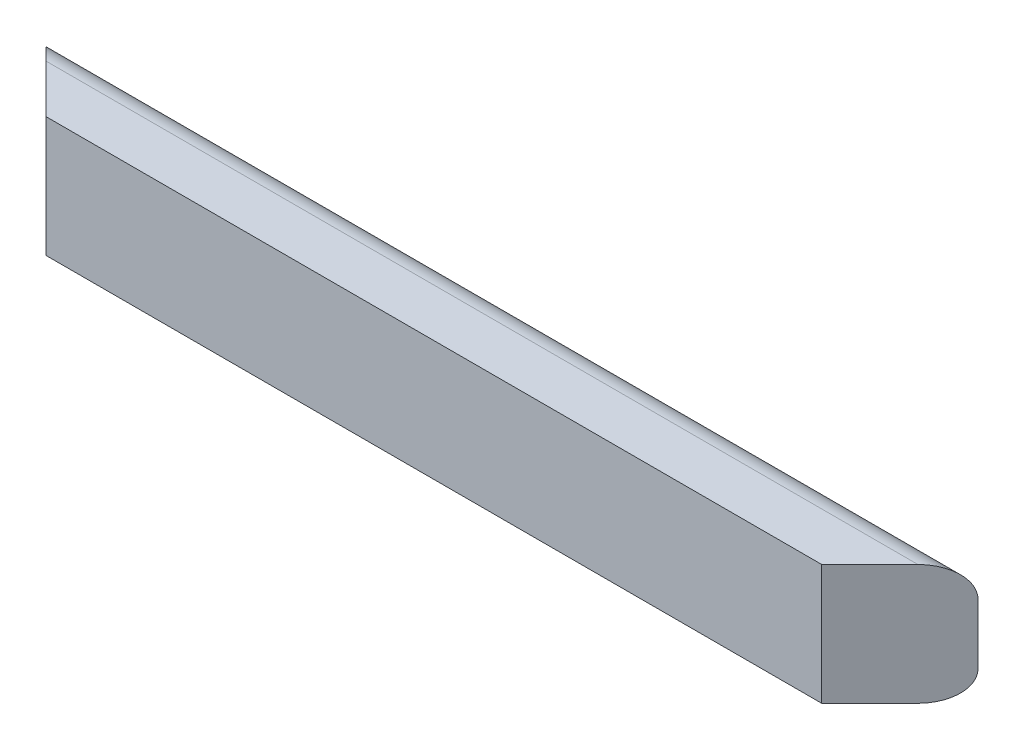
ISO-10303-21;
HEADER;
FILE_DESCRIPTION(('STEP AP214'),'2;1');
FILE_NAME('part.step','',(''),(''),'','','');
FILE_SCHEMA(('AUTOMOTIVE_DESIGN { 1 0 10303 214 1 1 1 1 }'));
ENDSEC;
DATA;
#1=APPLICATION_CONTEXT('core data for automotive mechanical design processes');
#2=APPLICATION_PROTOCOL_DEFINITION('international standard','automotive_design',2000,#1);
#3=PRODUCT_CONTEXT('',#1,'mechanical');
#4=PRODUCT('Part','Part','',(#3));
#5=PRODUCT_RELATED_PRODUCT_CATEGORY('part','',(#4));
#6=PRODUCT_DEFINITION_FORMATION('','',#4);
#7=PRODUCT_DEFINITION_CONTEXT('part definition',#1,'design');
#8=PRODUCT_DEFINITION('design','',#6,#7);
#9=PRODUCT_DEFINITION_SHAPE('','',#8);
#10=(LENGTH_UNIT() NAMED_UNIT(*) SI_UNIT(.MILLI.,.METRE.));
#11=(NAMED_UNIT(*) PLANE_ANGLE_UNIT() SI_UNIT($,.RADIAN.));
#12=(NAMED_UNIT(*) SI_UNIT($,.STERADIAN.) SOLID_ANGLE_UNIT());
#13=UNCERTAINTY_MEASURE_WITH_UNIT(LENGTH_MEASURE(1.E-05),#10,'distance_accuracy_value','');
#14=(GEOMETRIC_REPRESENTATION_CONTEXT(3) GLOBAL_UNCERTAINTY_ASSIGNED_CONTEXT((#13)) GLOBAL_UNIT_ASSIGNED_CONTEXT((#10,
#11,#12)) REPRESENTATION_CONTEXT('',''));
#15=CARTESIAN_POINT('',(0.,0.,0.));
#16=DIRECTION('',(0.,0.,1.));
#17=DIRECTION('',(1.,0.,0.));
#18=AXIS2_PLACEMENT_3D('',#15,#16,#17);
#19=CARTESIAN_POINT('',(984.25,0.,0.));
#20=DIRECTION('',(0.,1.,0.));
#21=DIRECTION('',(0.,0.,1.));
#22=AXIS2_PLACEMENT_3D('',#19,#20,#21);
#23=PLANE('',#22);
#24=DIRECTION('',(-1.,0.,0.));
#25=VECTOR('',#24,1.);
#26=CARTESIAN_POINT('',(984.25,0.,19.05));
#27=LINE('',#26,#25);
#28=CARTESIAN_POINT('',(901.7,0.,19.05));
#29=VERTEX_POINT('',#28);
#30=CARTESIAN_POINT('',(82.55,0.,19.05));
#31=VERTEX_POINT('',#30);
#32=EDGE_CURVE('E129',#29,#31,#27,.T.);
#33=ORIENTED_EDGE('',*,*,#32,.T.);
#34=DIRECTION('',(-0.707106781186549,0.,-0.707106781186546));
#35=VECTOR('',#34,1.);
#36=CARTESIAN_POINT('',(523.875000000001,0.,460.375));
#37=LINE('',#36,#35);
#38=CARTESIAN_POINT('',(31.7499999999999,0.,-31.75));
#39=VERTEX_POINT('',#38);
#40=EDGE_CURVE('E112',#31,#39,#37,.T.);
#41=ORIENTED_EDGE('',*,*,#40,.T.);
#42=DIRECTION('',(-1.,0.,0.));
#43=VECTOR('',#42,1.);
#44=CARTESIAN_POINT('',(984.25,0.,-31.75));
#45=LINE('',#44,#43);
#46=CARTESIAN_POINT('',(952.5,0.,-31.75));
#47=VERTEX_POINT('',#46);
#48=EDGE_CURVE('E11',#47,#39,#45,.T.);
#49=ORIENTED_EDGE('',*,*,#48,.F.);
#50=DIRECTION('',(-0.707106781186549,0.,0.707106781186546));
#51=VECTOR('',#50,1.);
#52=CARTESIAN_POINT('',(952.5,0.,-31.75));
#53=LINE('',#52,#51);
#54=EDGE_CURVE('E134',#47,#29,#53,.T.);
#55=ORIENTED_EDGE('',*,*,#54,.T.);
#56=EDGE_LOOP('',(#33,#41,#49,#55));
#57=FACE_BOUND('',#56,.T.);
#58=ADVANCED_FACE('F38',(#57),#23,.F.);
#59=CARTESIAN_POINT('',(984.25,31.75,-31.75));
#60=DIRECTION('',(-1.,0.,0.));
#61=DIRECTION('',(0.,0.,1.));
#62=AXIS2_PLACEMENT_3D('',#59,#60,#61);
#63=CYLINDRICAL_SURFACE('',#62,31.75);
#64=ORIENTED_EDGE('',*,*,#48,.T.);
#65=CARTESIAN_POINT('',(31.7499999999998,31.75,-31.75));
#66=DIRECTION('',(0.707106781186546,0.,-0.707106781186549));
#67=DIRECTION('',(-0.707106781186549,0.,-0.707106781186546));
#68=AXIS2_PLACEMENT_3D('',#65,#66,#67);
#69=ELLIPSE('',#68,44.9012806053458,31.75);
#70=CARTESIAN_POINT('',(0.,31.75,-63.4999999999998));
#71=VERTEX_POINT('',#70);
#72=EDGE_CURVE('E95',#39,#71,#69,.T.);
#73=ORIENTED_EDGE('',*,*,#72,.T.);
#74=DIRECTION('',(-1.,0.,0.));
#75=VECTOR('',#74,1.);
#76=CARTESIAN_POINT('',(984.25,31.75,-63.5));
#77=LINE('',#76,#75);
#78=CARTESIAN_POINT('',(984.25,31.75,-63.5));
#79=VERTEX_POINT('',#78);
#80=EDGE_CURVE('E47',#79,#71,#77,.T.);
#81=ORIENTED_EDGE('',*,*,#80,.F.);
#82=CARTESIAN_POINT('',(952.5,31.75,-31.75));
#83=DIRECTION('',(-0.707106781186546,0.,-0.707106781186549));
#84=DIRECTION('',(-0.707106781186549,0.,0.707106781186546));
#85=AXIS2_PLACEMENT_3D('',#82,#83,#84);
#86=ELLIPSE('',#85,44.9012806053458,31.75);
#87=EDGE_CURVE('E53',#79,#47,#86,.T.);
#88=ORIENTED_EDGE('',*,*,#87,.T.);
#89=EDGE_LOOP('',(#64,#73,#81,#88));
#90=FACE_BOUND('',#89,.T.);
#91=ADVANCED_FACE('F107',(#90),#63,.T.);
#92=CARTESIAN_POINT('',(984.25,95.25,-63.5));
#93=DIRECTION('',(0.,0.,1.));
#94=DIRECTION('',(1.,0.,0.));
#95=AXIS2_PLACEMENT_3D('',#92,#93,#94);
#96=PLANE('',#95);
#97=DIRECTION('',(0.,1.,0.));
#98=VECTOR('',#97,1.);
#99=CARTESIAN_POINT('',(0.,95.25,-63.5));
#100=LINE('',#99,#98);
#101=CARTESIAN_POINT('',(0.,95.25,-63.5));
#102=VERTEX_POINT('',#101);
#103=EDGE_CURVE('E92',#71,#102,#100,.T.);
#104=ORIENTED_EDGE('',*,*,#103,.T.);
#105=DIRECTION('',(-1.,0.,0.));
#106=VECTOR('',#105,1.);
#107=CARTESIAN_POINT('',(984.25,95.25,-63.5));
#108=LINE('',#107,#106);
#109=CARTESIAN_POINT('',(984.25,95.25,-63.4999999999998));
#110=VERTEX_POINT('',#109);
#111=EDGE_CURVE('E116',#110,#102,#108,.T.);
#112=ORIENTED_EDGE('',*,*,#111,.F.);
#113=DIRECTION('',(0.,1.,0.));
#114=VECTOR('',#113,1.);
#115=CARTESIAN_POINT('',(984.25,95.25,-63.5));
#116=LINE('',#115,#114);
#117=EDGE_CURVE('E104',#79,#110,#116,.T.);
#118=ORIENTED_EDGE('',*,*,#117,.F.);
#119=ORIENTED_EDGE('',*,*,#80,.T.);
#120=EDGE_LOOP('',(#104,#112,#118,#119));
#121=FACE_BOUND('',#120,.T.);
#122=ADVANCED_FACE('F114',(#121),#96,.F.);
#123=CARTESIAN_POINT('',(984.25,95.25,-31.75));
#124=DIRECTION('',(-1.,0.,0.));
#125=DIRECTION('',(0.,0.,1.));
#126=AXIS2_PLACEMENT_3D('',#123,#124,#125);
#127=CYLINDRICAL_SURFACE('',#126,31.75);
#128=ORIENTED_EDGE('',*,*,#111,.T.);
#129=CARTESIAN_POINT('',(31.7499999999998,95.25,-31.75));
#130=DIRECTION('',(0.707106781186546,0.,-0.707106781186549));
#131=DIRECTION('',(-0.707106781186549,0.,-0.707106781186546));
#132=AXIS2_PLACEMENT_3D('',#129,#130,#131);
#133=ELLIPSE('',#132,44.9012806053458,31.75);
#134=CARTESIAN_POINT('',(31.7499999999998,127.,-31.75));
#135=VERTEX_POINT('',#134);
#136=EDGE_CURVE('E98',#102,#135,#133,.T.);
#137=ORIENTED_EDGE('',*,*,#136,.T.);
#138=DIRECTION('',(-1.,0.,0.));
#139=VECTOR('',#138,1.);
#140=CARTESIAN_POINT('',(984.25,127.,-31.75));
#141=LINE('',#140,#139);
#142=CARTESIAN_POINT('',(952.5,127.,-31.75));
#143=VERTEX_POINT('',#142);
#144=EDGE_CURVE('E120',#143,#135,#141,.T.);
#145=ORIENTED_EDGE('',*,*,#144,.F.);
#146=CARTESIAN_POINT('',(952.5,95.25,-31.75));
#147=DIRECTION('',(-0.707106781186546,0.,-0.707106781186549));
#148=DIRECTION('',(-0.707106781186549,0.,0.707106781186546));
#149=AXIS2_PLACEMENT_3D('',#146,#147,#148);
#150=ELLIPSE('',#149,44.9012806053458,31.75);
#151=EDGE_CURVE('E111',#143,#110,#150,.T.);
#152=ORIENTED_EDGE('',*,*,#151,.T.);
#153=EDGE_LOOP('',(#128,#137,#145,#152));
#154=FACE_BOUND('',#153,.T.);
#155=ADVANCED_FACE('F160',(#154),#127,.T.);
#156=CARTESIAN_POINT('',(984.25,127.,19.05));
#157=DIRECTION('',(0.,-1.,0.));
#158=DIRECTION('',(0.,0.,-1.));
#159=AXIS2_PLACEMENT_3D('',#156,#157,#158);
#160=PLANE('',#159);
#161=ORIENTED_EDGE('',*,*,#144,.T.);
#162=DIRECTION('',(0.707106781186549,0.,0.707106781186546));
#163=VECTOR('',#162,1.);
#164=CARTESIAN_POINT('',(533.400000000001,127.000000000001,469.9));
#165=LINE('',#164,#163);
#166=CARTESIAN_POINT('',(82.5500000000001,127.,19.05));
#167=VERTEX_POINT('',#166);
#168=EDGE_CURVE('E153',#135,#167,#165,.T.);
#169=ORIENTED_EDGE('',*,*,#168,.T.);
#170=DIRECTION('',(-1.,0.,0.));
#171=VECTOR('',#170,1.);
#172=CARTESIAN_POINT('',(984.25,127.,19.05));
#173=LINE('',#172,#171);
#174=CARTESIAN_POINT('',(901.7,127.,19.05));
#175=VERTEX_POINT('',#174);
#176=EDGE_CURVE('E126',#175,#167,#173,.T.);
#177=ORIENTED_EDGE('',*,*,#176,.F.);
#178=DIRECTION('',(0.707106781186549,0.,-0.707106781186546));
#179=VECTOR('',#178,1.);
#180=CARTESIAN_POINT('',(942.975,127.,-22.225));
#181=LINE('',#180,#179);
#182=EDGE_CURVE('E140',#175,#143,#181,.T.);
#183=ORIENTED_EDGE('',*,*,#182,.T.);
#184=EDGE_LOOP('',(#161,#169,#177,#183));
#185=FACE_BOUND('',#184,.T.);
#186=ADVANCED_FACE('F162',(#185),#160,.F.);
#187=CARTESIAN_POINT('',(984.25,0.,19.05));
#188=DIRECTION('',(0.,0.,-1.));
#189=DIRECTION('',(-1.,0.,0.));
#190=AXIS2_PLACEMENT_3D('',#187,#188,#189);
#191=PLANE('',#190);
#192=ORIENTED_EDGE('',*,*,#176,.T.);
#193=DIRECTION('',(0.,-1.,0.));
#194=VECTOR('',#193,1.);
#195=CARTESIAN_POINT('',(82.55,0.,19.05));
#196=LINE('',#195,#194);
#197=EDGE_CURVE('E149',#167,#31,#196,.T.);
#198=ORIENTED_EDGE('',*,*,#197,.T.);
#199=ORIENTED_EDGE('',*,*,#32,.F.);
#200=DIRECTION('',(0.,1.,0.));
#201=VECTOR('',#200,1.);
#202=CARTESIAN_POINT('',(901.7,0.,19.05));
#203=LINE('',#202,#201);
#204=EDGE_CURVE('E137',#29,#175,#203,.T.);
#205=ORIENTED_EDGE('',*,*,#204,.T.);
#206=EDGE_LOOP('',(#192,#198,#199,#205));
#207=FACE_BOUND('',#206,.T.);
#208=ADVANCED_FACE('F167',(#207),#191,.F.);
#209=CARTESIAN_POINT('',(460.374999999999,0.,460.375));
#210=DIRECTION('',(-0.707106781186546,0.,-0.707106781186549));
#211=DIRECTION('',(-0.707106781186549,0.,0.707106781186546));
#212=AXIS2_PLACEMENT_3D('',#209,#210,#211);
#213=PLANE('',#212);
#214=ORIENTED_EDGE('',*,*,#117,.T.);
#215=ORIENTED_EDGE('',*,*,#151,.F.);
#216=ORIENTED_EDGE('',*,*,#182,.F.);
#217=ORIENTED_EDGE('',*,*,#204,.F.);
#218=ORIENTED_EDGE('',*,*,#54,.F.);
#219=ORIENTED_EDGE('',*,*,#87,.F.);
#220=EDGE_LOOP('',(#214,#215,#216,#217,#218,#219));
#221=FACE_BOUND('',#220,.T.);
#222=ADVANCED_FACE('F164',(#221),#213,.F.);
#223=CARTESIAN_POINT('',(523.875000000001,0.,460.375));
#224=DIRECTION('',(0.707106781186546,0.,-0.707106781186549));
#225=DIRECTION('',(0.707106781186549,0.,0.707106781186546));
#226=AXIS2_PLACEMENT_3D('',#223,#224,#225);
#227=PLANE('',#226);
#228=ORIENTED_EDGE('',*,*,#40,.F.);
#229=ORIENTED_EDGE('',*,*,#197,.F.);
#230=ORIENTED_EDGE('',*,*,#168,.F.);
#231=ORIENTED_EDGE('',*,*,#136,.F.);
#232=ORIENTED_EDGE('',*,*,#103,.F.);
#233=ORIENTED_EDGE('',*,*,#72,.F.);
#234=EDGE_LOOP('',(#228,#229,#230,#231,#232,#233));
#235=FACE_BOUND('',#234,.T.);
#236=ADVANCED_FACE('F94',(#235),#227,.F.);
#237=CLOSED_SHELL('',(#58,#91,#122,#155,#186,#208,#222,#236));
#238=MANIFOLD_SOLID_BREP('B2',#237);
#239=ADVANCED_BREP_SHAPE_REPRESENTATION('',(#18,#238),#14);
#240=SHAPE_DEFINITION_REPRESENTATION(#9,#239);
ENDSEC;
END-ISO-10303-21;
